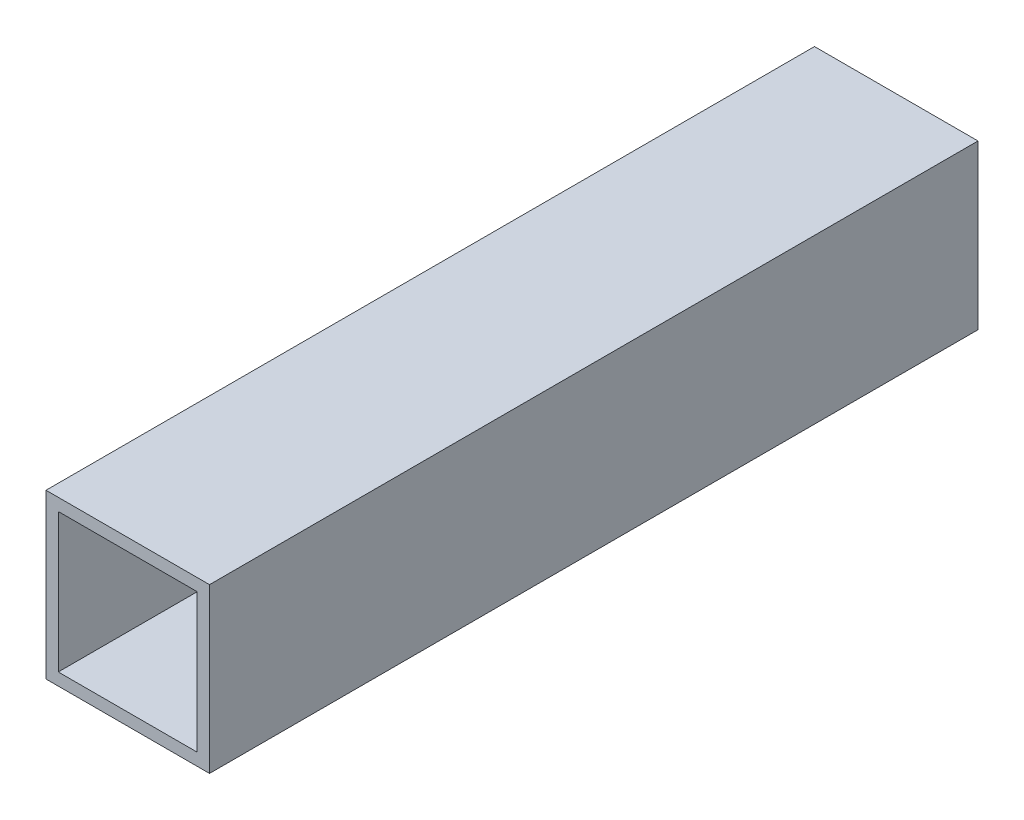
ISO-10303-21;
HEADER;
FILE_DESCRIPTION(('STEP AP214'),'2;1');
FILE_NAME('part.step','',(''),(''),'','','');
FILE_SCHEMA(('AUTOMOTIVE_DESIGN { 1 0 10303 214 1 1 1 1 }'));
ENDSEC;
DATA;
#1=APPLICATION_CONTEXT('core data for automotive mechanical design processes');
#2=APPLICATION_PROTOCOL_DEFINITION('international standard','automotive_design',2000,#1);
#3=PRODUCT_CONTEXT('',#1,'mechanical');
#4=PRODUCT('Part','Part','',(#3));
#5=PRODUCT_RELATED_PRODUCT_CATEGORY('part','',(#4));
#6=PRODUCT_DEFINITION_FORMATION('','',#4);
#7=PRODUCT_DEFINITION_CONTEXT('part definition',#1,'design');
#8=PRODUCT_DEFINITION('design','',#6,#7);
#9=PRODUCT_DEFINITION_SHAPE('','',#8);
#10=(LENGTH_UNIT() NAMED_UNIT(*) SI_UNIT(.MILLI.,.METRE.));
#11=(NAMED_UNIT(*) PLANE_ANGLE_UNIT() SI_UNIT($,.RADIAN.));
#12=(NAMED_UNIT(*) SI_UNIT($,.STERADIAN.) SOLID_ANGLE_UNIT());
#13=UNCERTAINTY_MEASURE_WITH_UNIT(LENGTH_MEASURE(1.E-05),#10,'distance_accuracy_value','');
#14=(GEOMETRIC_REPRESENTATION_CONTEXT(3) GLOBAL_UNCERTAINTY_ASSIGNED_CONTEXT((#13)) GLOBAL_UNIT_ASSIGNED_CONTEXT((#10,
#11,#12)) REPRESENTATION_CONTEXT('',''));
#15=CARTESIAN_POINT('',(0.,0.,0.));
#16=DIRECTION('',(0.,0.,1.));
#17=DIRECTION('',(1.,0.,0.));
#18=AXIS2_PLACEMENT_3D('',#15,#16,#17);
#19=CARTESIAN_POINT('',(0.,0.,94.));
#20=DIRECTION('',(0.,0.,1.));
#21=DIRECTION('',(1.,0.,0.));
#22=AXIS2_PLACEMENT_3D('',#19,#20,#21);
#23=PLANE('',#22);
#24=DIRECTION('',(0.,-1.,0.));
#25=VECTOR('',#24,1.);
#26=CARTESIAN_POINT('',(-8.16595705295675,8.5227233045029,94.));
#27=LINE('',#26,#25);
#28=CARTESIAN_POINT('',(-8.16595705295675,8.5227233045029,94.));
#29=VERTEX_POINT('',#28);
#30=CARTESIAN_POINT('',(-8.16595705295675,-11.4772766954971,94.));
#31=VERTEX_POINT('',#30);
#32=EDGE_CURVE('E153',#29,#31,#27,.T.);
#33=ORIENTED_EDGE('',*,*,#32,.T.);
#34=DIRECTION('',(1.,0.,0.));
#35=VECTOR('',#34,1.);
#36=CARTESIAN_POINT('',(-8.16595705295675,-11.4772766954971,94.));
#37=LINE('',#36,#35);
#38=CARTESIAN_POINT('',(11.8340429470433,-11.4772766954971,94.));
#39=VERTEX_POINT('',#38);
#40=EDGE_CURVE('E157',#31,#39,#37,.T.);
#41=ORIENTED_EDGE('',*,*,#40,.T.);
#42=DIRECTION('',(0.,1.,0.));
#43=VECTOR('',#42,1.);
#44=CARTESIAN_POINT('',(11.8340429470433,8.5227233045029,94.));
#45=LINE('',#44,#43);
#46=CARTESIAN_POINT('',(11.8340429470433,8.5227233045029,94.));
#47=VERTEX_POINT('',#46);
#48=EDGE_CURVE('E161',#39,#47,#45,.T.);
#49=ORIENTED_EDGE('',*,*,#48,.T.);
#50=DIRECTION('',(-1.,0.,0.));
#51=VECTOR('',#50,1.);
#52=CARTESIAN_POINT('',(-8.16595705295675,8.5227233045029,94.));
#53=LINE('',#52,#51);
#54=EDGE_CURVE('E164',#47,#29,#53,.T.);
#55=ORIENTED_EDGE('',*,*,#54,.T.);
#56=EDGE_LOOP('',(#33,#41,#49,#55));
#57=FACE_BOUND('',#56,.T.);
#58=DIRECTION('',(1.,0.,0.));
#59=VECTOR('',#58,1.);
#60=CARTESIAN_POINT('',(-6.66595705295675,-9.9772766954971,94.));
#61=LINE('',#60,#59);
#62=CARTESIAN_POINT('',(-6.66595705295675,-9.9772766954971,94.));
#63=VERTEX_POINT('',#62);
#64=CARTESIAN_POINT('',(10.3340429470433,-9.9772766954971,94.));
#65=VERTEX_POINT('',#64);
#66=EDGE_CURVE('E114',#63,#65,#61,.T.);
#67=ORIENTED_EDGE('',*,*,#66,.F.);
#68=DIRECTION('',(0.,-1.,0.));
#69=VECTOR('',#68,1.);
#70=CARTESIAN_POINT('',(-6.66595705295675,7.0227233045029,94.));
#71=LINE('',#70,#69);
#72=CARTESIAN_POINT('',(-6.66595705295675,7.0227233045029,94.));
#73=VERTEX_POINT('',#72);
#74=EDGE_CURVE('E105',#73,#63,#71,.T.);
#75=ORIENTED_EDGE('',*,*,#74,.F.);
#76=DIRECTION('',(-1.,0.,0.));
#77=VECTOR('',#76,1.);
#78=CARTESIAN_POINT('',(-6.66595705295675,7.0227233045029,94.));
#79=LINE('',#78,#77);
#80=CARTESIAN_POINT('',(10.3340429470433,7.0227233045029,94.));
#81=VERTEX_POINT('',#80);
#82=EDGE_CURVE('E131',#81,#73,#79,.T.);
#83=ORIENTED_EDGE('',*,*,#82,.F.);
#84=DIRECTION('',(0.,1.,0.));
#85=VECTOR('',#84,1.);
#86=CARTESIAN_POINT('',(10.3340429470433,7.0227233045029,94.));
#87=LINE('',#86,#85);
#88=EDGE_CURVE('E127',#65,#81,#87,.T.);
#89=ORIENTED_EDGE('',*,*,#88,.F.);
#90=EDGE_LOOP('',(#67,#75,#83,#89));
#91=FACE_BOUND('',#90,.T.);
#92=ADVANCED_FACE('F39',(#57,#91),#23,.T.);
#93=CARTESIAN_POINT('',(0.,0.,0.));
#94=DIRECTION('',(0.,0.,1.));
#95=DIRECTION('',(1.,0.,0.));
#96=AXIS2_PLACEMENT_3D('',#93,#94,#95);
#97=PLANE('',#96);
#98=DIRECTION('',(0.,-1.,0.));
#99=VECTOR('',#98,1.);
#100=CARTESIAN_POINT('',(-8.16595705295675,8.5227233045029,0.));
#101=LINE('',#100,#99);
#102=CARTESIAN_POINT('',(-8.16595705295675,8.5227233045029,0.));
#103=VERTEX_POINT('',#102);
#104=CARTESIAN_POINT('',(-8.16595705295675,-11.4772766954971,0.));
#105=VERTEX_POINT('',#104);
#106=EDGE_CURVE('E123',#103,#105,#101,.T.);
#107=ORIENTED_EDGE('',*,*,#106,.F.);
#108=DIRECTION('',(-1.,0.,0.));
#109=VECTOR('',#108,1.);
#110=CARTESIAN_POINT('',(-8.16595705295675,8.5227233045029,0.));
#111=LINE('',#110,#109);
#112=CARTESIAN_POINT('',(11.8340429470433,8.5227233045029,0.));
#113=VERTEX_POINT('',#112);
#114=EDGE_CURVE('E158',#113,#103,#111,.T.);
#115=ORIENTED_EDGE('',*,*,#114,.F.);
#116=DIRECTION('',(0.,1.,0.));
#117=VECTOR('',#116,1.);
#118=CARTESIAN_POINT('',(11.8340429470433,8.5227233045029,0.));
#119=LINE('',#118,#117);
#120=CARTESIAN_POINT('',(11.8340429470433,-11.4772766954971,0.));
#121=VERTEX_POINT('',#120);
#122=EDGE_CURVE('E174',#121,#113,#119,.T.);
#123=ORIENTED_EDGE('',*,*,#122,.F.);
#124=DIRECTION('',(1.,0.,0.));
#125=VECTOR('',#124,1.);
#126=CARTESIAN_POINT('',(-8.16595705295675,-11.4772766954971,0.));
#127=LINE('',#126,#125);
#128=EDGE_CURVE('E171',#105,#121,#127,.T.);
#129=ORIENTED_EDGE('',*,*,#128,.F.);
#130=EDGE_LOOP('',(#107,#115,#123,#129));
#131=FACE_BOUND('',#130,.T.);
#132=DIRECTION('',(0.,-1.,0.));
#133=VECTOR('',#132,1.);
#134=CARTESIAN_POINT('',(-6.66595705295675,7.0227233045029,0.));
#135=LINE('',#134,#133);
#136=CARTESIAN_POINT('',(-6.66595705295675,7.0227233045029,0.));
#137=VERTEX_POINT('',#136);
#138=CARTESIAN_POINT('',(-6.66595705295675,-9.9772766954971,0.));
#139=VERTEX_POINT('',#138);
#140=EDGE_CURVE('E63',#137,#139,#135,.T.);
#141=ORIENTED_EDGE('',*,*,#140,.T.);
#142=DIRECTION('',(1.,0.,0.));
#143=VECTOR('',#142,1.);
#144=CARTESIAN_POINT('',(-6.66595705295675,-9.9772766954971,0.));
#145=LINE('',#144,#143);
#146=CARTESIAN_POINT('',(10.3340429470433,-9.9772766954971,0.));
#147=VERTEX_POINT('',#146);
#148=EDGE_CURVE('E121',#139,#147,#145,.T.);
#149=ORIENTED_EDGE('',*,*,#148,.T.);
#150=DIRECTION('',(0.,1.,0.));
#151=VECTOR('',#150,1.);
#152=CARTESIAN_POINT('',(10.3340429470433,7.0227233045029,0.));
#153=LINE('',#152,#151);
#154=CARTESIAN_POINT('',(10.3340429470433,7.0227233045029,0.));
#155=VERTEX_POINT('',#154);
#156=EDGE_CURVE('E140',#147,#155,#153,.T.);
#157=ORIENTED_EDGE('',*,*,#156,.T.);
#158=DIRECTION('',(-1.,0.,0.));
#159=VECTOR('',#158,1.);
#160=CARTESIAN_POINT('',(-6.66595705295675,7.0227233045029,0.));
#161=LINE('',#160,#159);
#162=EDGE_CURVE('E115',#155,#137,#161,.T.);
#163=ORIENTED_EDGE('',*,*,#162,.T.);
#164=EDGE_LOOP('',(#141,#149,#157,#163));
#165=FACE_BOUND('',#164,.T.);
#166=ADVANCED_FACE('F197',(#131,#165),#97,.F.);
#167=CARTESIAN_POINT('',(-8.16595705295675,8.5227233045029,94.));
#168=DIRECTION('',(1.,0.,0.));
#169=DIRECTION('',(0.,1.,0.));
#170=AXIS2_PLACEMENT_3D('',#167,#168,#169);
#171=PLANE('',#170);
#172=ORIENTED_EDGE('',*,*,#106,.T.);
#173=DIRECTION('',(0.,0.,-1.));
#174=VECTOR('',#173,1.);
#175=CARTESIAN_POINT('',(-8.16595705295675,-11.4772766954971,94.));
#176=LINE('',#175,#174);
#177=EDGE_CURVE('E11',#31,#105,#176,.T.);
#178=ORIENTED_EDGE('',*,*,#177,.F.);
#179=ORIENTED_EDGE('',*,*,#32,.F.);
#180=DIRECTION('',(0.,0.,-1.));
#181=VECTOR('',#180,1.);
#182=CARTESIAN_POINT('',(-8.16595705295675,8.5227233045029,94.));
#183=LINE('',#182,#181);
#184=EDGE_CURVE('E167',#29,#103,#183,.T.);
#185=ORIENTED_EDGE('',*,*,#184,.T.);
#186=EDGE_LOOP('',(#172,#178,#179,#185));
#187=FACE_BOUND('',#186,.T.);
#188=ADVANCED_FACE('F41',(#187),#171,.F.);
#189=CARTESIAN_POINT('',(-8.16595705295675,-11.4772766954971,94.));
#190=DIRECTION('',(0.,1.,0.));
#191=DIRECTION('',(0.,0.,1.));
#192=AXIS2_PLACEMENT_3D('',#189,#190,#191);
#193=PLANE('',#192);
#194=ORIENTED_EDGE('',*,*,#128,.T.);
#195=DIRECTION('',(0.,0.,-1.));
#196=VECTOR('',#195,1.);
#197=CARTESIAN_POINT('',(11.8340429470433,-11.4772766954971,94.));
#198=LINE('',#197,#196);
#199=EDGE_CURVE('E48',#39,#121,#198,.T.);
#200=ORIENTED_EDGE('',*,*,#199,.F.);
#201=ORIENTED_EDGE('',*,*,#40,.F.);
#202=ORIENTED_EDGE('',*,*,#177,.T.);
#203=EDGE_LOOP('',(#194,#200,#201,#202));
#204=FACE_BOUND('',#203,.T.);
#205=ADVANCED_FACE('F207',(#204),#193,.F.);
#206=CARTESIAN_POINT('',(11.8340429470433,8.5227233045029,94.));
#207=DIRECTION('',(-1.,0.,0.));
#208=DIRECTION('',(0.,-1.,0.));
#209=AXIS2_PLACEMENT_3D('',#206,#207,#208);
#210=PLANE('',#209);
#211=ORIENTED_EDGE('',*,*,#122,.T.);
#212=DIRECTION('',(0.,0.,-1.));
#213=VECTOR('',#212,1.);
#214=CARTESIAN_POINT('',(11.8340429470433,8.5227233045029,94.));
#215=LINE('',#214,#213);
#216=EDGE_CURVE('E182',#47,#113,#215,.T.);
#217=ORIENTED_EDGE('',*,*,#216,.F.);
#218=ORIENTED_EDGE('',*,*,#48,.F.);
#219=ORIENTED_EDGE('',*,*,#199,.T.);
#220=EDGE_LOOP('',(#211,#217,#218,#219));
#221=FACE_BOUND('',#220,.T.);
#222=ADVANCED_FACE('F191',(#221),#210,.F.);
#223=CARTESIAN_POINT('',(-8.16595705295675,8.5227233045029,94.));
#224=DIRECTION('',(0.,-1.,0.));
#225=DIRECTION('',(0.,0.,-1.));
#226=AXIS2_PLACEMENT_3D('',#223,#224,#225);
#227=PLANE('',#226);
#228=ORIENTED_EDGE('',*,*,#114,.T.);
#229=ORIENTED_EDGE('',*,*,#184,.F.);
#230=ORIENTED_EDGE('',*,*,#54,.F.);
#231=ORIENTED_EDGE('',*,*,#216,.T.);
#232=EDGE_LOOP('',(#228,#229,#230,#231));
#233=FACE_BOUND('',#232,.T.);
#234=ADVANCED_FACE('F201',(#233),#227,.F.);
#235=CARTESIAN_POINT('',(-6.66595705295675,7.0227233045029,94.));
#236=DIRECTION('',(1.,0.,0.));
#237=DIRECTION('',(0.,0.,-1.));
#238=AXIS2_PLACEMENT_3D('',#235,#236,#237);
#239=PLANE('',#238);
#240=ORIENTED_EDGE('',*,*,#140,.F.);
#241=DIRECTION('',(0.,0.,-1.));
#242=VECTOR('',#241,1.);
#243=CARTESIAN_POINT('',(-6.66595705295675,7.0227233045029,94.));
#244=LINE('',#243,#242);
#245=EDGE_CURVE('E109',#73,#137,#244,.T.);
#246=ORIENTED_EDGE('',*,*,#245,.F.);
#247=ORIENTED_EDGE('',*,*,#74,.T.);
#248=DIRECTION('',(0.,0.,-1.));
#249=VECTOR('',#248,1.);
#250=CARTESIAN_POINT('',(-6.66595705295675,-9.9772766954971,94.));
#251=LINE('',#250,#249);
#252=EDGE_CURVE('E108',#63,#139,#251,.T.);
#253=ORIENTED_EDGE('',*,*,#252,.T.);
#254=EDGE_LOOP('',(#240,#246,#247,#253));
#255=FACE_BOUND('',#254,.T.);
#256=ADVANCED_FACE('F107',(#255),#239,.T.);
#257=CARTESIAN_POINT('',(-6.66595705295675,-9.9772766954971,94.));
#258=DIRECTION('',(0.,1.,0.));
#259=DIRECTION('',(-1.,0.,0.));
#260=AXIS2_PLACEMENT_3D('',#257,#258,#259);
#261=PLANE('',#260);
#262=ORIENTED_EDGE('',*,*,#148,.F.);
#263=ORIENTED_EDGE('',*,*,#252,.F.);
#264=ORIENTED_EDGE('',*,*,#66,.T.);
#265=DIRECTION('',(0.,0.,-1.));
#266=VECTOR('',#265,1.);
#267=CARTESIAN_POINT('',(10.3340429470433,-9.9772766954971,94.));
#268=LINE('',#267,#266);
#269=EDGE_CURVE('E124',#65,#147,#268,.T.);
#270=ORIENTED_EDGE('',*,*,#269,.T.);
#271=EDGE_LOOP('',(#262,#263,#264,#270));
#272=FACE_BOUND('',#271,.T.);
#273=ADVANCED_FACE('F118',(#272),#261,.T.);
#274=CARTESIAN_POINT('',(10.3340429470433,7.0227233045029,94.));
#275=DIRECTION('',(-1.,0.,0.));
#276=DIRECTION('',(0.,0.,1.));
#277=AXIS2_PLACEMENT_3D('',#274,#275,#276);
#278=PLANE('',#277);
#279=ORIENTED_EDGE('',*,*,#156,.F.);
#280=ORIENTED_EDGE('',*,*,#269,.F.);
#281=ORIENTED_EDGE('',*,*,#88,.T.);
#282=DIRECTION('',(0.,0.,-1.));
#283=VECTOR('',#282,1.);
#284=CARTESIAN_POINT('',(10.3340429470433,7.0227233045029,94.));
#285=LINE('',#284,#283);
#286=EDGE_CURVE('E55',#81,#155,#285,.T.);
#287=ORIENTED_EDGE('',*,*,#286,.T.);
#288=EDGE_LOOP('',(#279,#280,#281,#287));
#289=FACE_BOUND('',#288,.T.);
#290=ADVANCED_FACE('F230',(#289),#278,.T.);
#291=CARTESIAN_POINT('',(-6.66595705295675,7.0227233045029,94.));
#292=DIRECTION('',(0.,-1.,0.));
#293=DIRECTION('',(0.,0.,-1.));
#294=AXIS2_PLACEMENT_3D('',#291,#292,#293);
#295=PLANE('',#294);
#296=ORIENTED_EDGE('',*,*,#162,.F.);
#297=ORIENTED_EDGE('',*,*,#286,.F.);
#298=ORIENTED_EDGE('',*,*,#82,.T.);
#299=ORIENTED_EDGE('',*,*,#245,.T.);
#300=EDGE_LOOP('',(#296,#297,#298,#299));
#301=FACE_BOUND('',#300,.T.);
#302=ADVANCED_FACE('F234',(#301),#295,.T.);
#303=CLOSED_SHELL('',(#92,#166,#188,#205,#222,#234,#256,#273,#290,#302));
#304=MANIFOLD_SOLID_BREP('B2',#303);
#305=ADVANCED_BREP_SHAPE_REPRESENTATION('',(#18,#304),#14);
#306=SHAPE_DEFINITION_REPRESENTATION(#9,#305);
ENDSEC;
END-ISO-10303-21;
